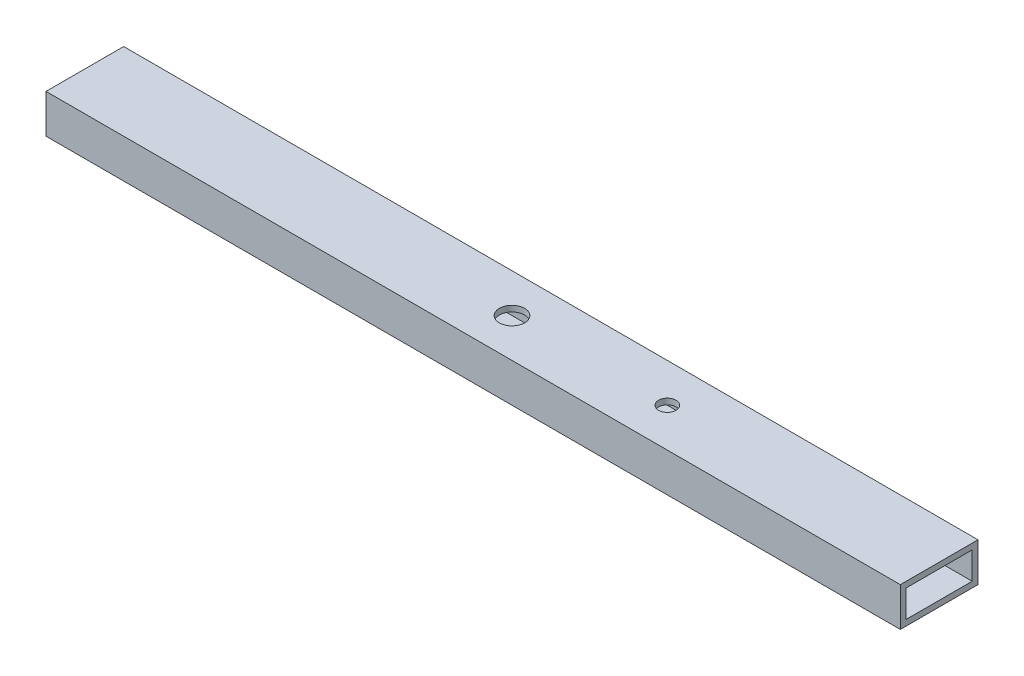
ISO-10303-21;
HEADER;
FILE_DESCRIPTION(('STEP AP214'),'2;1');
FILE_NAME('part.step','',(''),(''),'','','');
FILE_SCHEMA(('AUTOMOTIVE_DESIGN { 1 0 10303 214 1 1 1 1 }'));
ENDSEC;
DATA;
#1=APPLICATION_CONTEXT('core data for automotive mechanical design processes');
#2=APPLICATION_PROTOCOL_DEFINITION('international standard','automotive_design',2000,#1);
#3=PRODUCT_CONTEXT('',#1,'mechanical');
#4=PRODUCT('Part','Part','',(#3));
#5=PRODUCT_RELATED_PRODUCT_CATEGORY('part','',(#4));
#6=PRODUCT_DEFINITION_FORMATION('','',#4);
#7=PRODUCT_DEFINITION_CONTEXT('part definition',#1,'design');
#8=PRODUCT_DEFINITION('design','',#6,#7);
#9=PRODUCT_DEFINITION_SHAPE('','',#8);
#10=(LENGTH_UNIT() NAMED_UNIT(*) SI_UNIT(.MILLI.,.METRE.));
#11=(NAMED_UNIT(*) PLANE_ANGLE_UNIT() SI_UNIT($,.RADIAN.));
#12=(NAMED_UNIT(*) SI_UNIT($,.STERADIAN.) SOLID_ANGLE_UNIT());
#13=UNCERTAINTY_MEASURE_WITH_UNIT(LENGTH_MEASURE(1.E-05),#10,'distance_accuracy_value','');
#14=(GEOMETRIC_REPRESENTATION_CONTEXT(3) GLOBAL_UNCERTAINTY_ASSIGNED_CONTEXT((#13)) GLOBAL_UNIT_ASSIGNED_CONTEXT((#10,
#11,#12)) REPRESENTATION_CONTEXT('',''));
#15=CARTESIAN_POINT('',(0.,0.,0.));
#16=DIRECTION('',(0.,0.,1.));
#17=DIRECTION('',(1.,0.,0.));
#18=AXIS2_PLACEMENT_3D('',#15,#16,#17);
#19=CARTESIAN_POINT('',(220.,0.,0.));
#20=DIRECTION('',(1.,0.,0.));
#21=DIRECTION('',(0.,0.,-1.));
#22=AXIS2_PLACEMENT_3D('',#19,#20,#21);
#23=PLANE('',#22);
#24=DIRECTION('',(0.,1.,0.));
#25=VECTOR('',#24,1.);
#26=CARTESIAN_POINT('',(220.,5.,-10.));
#27=LINE('',#26,#25);
#28=CARTESIAN_POINT('',(220.,-5.,-10.));
#29=VERTEX_POINT('',#28);
#30=CARTESIAN_POINT('',(220.,5.,-10.));
#31=VERTEX_POINT('',#30);
#32=EDGE_CURVE('E138',#29,#31,#27,.T.);
#33=ORIENTED_EDGE('',*,*,#32,.T.);
#34=DIRECTION('',(0.,0.,1.));
#35=VECTOR('',#34,1.);
#36=CARTESIAN_POINT('',(220.,5.,10.));
#37=LINE('',#36,#35);
#38=CARTESIAN_POINT('',(220.,5.,10.));
#39=VERTEX_POINT('',#38);
#40=EDGE_CURVE('E141',#31,#39,#37,.T.);
#41=ORIENTED_EDGE('',*,*,#40,.T.);
#42=DIRECTION('',(0.,-1.,0.));
#43=VECTOR('',#42,1.);
#44=CARTESIAN_POINT('',(220.,5.,10.));
#45=LINE('',#44,#43);
#46=CARTESIAN_POINT('',(220.,-5.,10.));
#47=VERTEX_POINT('',#46);
#48=EDGE_CURVE('E144',#39,#47,#45,.T.);
#49=ORIENTED_EDGE('',*,*,#48,.T.);
#50=DIRECTION('',(0.,0.,-1.));
#51=VECTOR('',#50,1.);
#52=CARTESIAN_POINT('',(220.,-5.,10.));
#53=LINE('',#52,#51);
#54=EDGE_CURVE('E146',#47,#29,#53,.T.);
#55=ORIENTED_EDGE('',*,*,#54,.T.);
#56=EDGE_LOOP('',(#33,#41,#49,#55));
#57=FACE_BOUND('',#56,.T.);
#58=DIRECTION('',(0.,0.,-1.));
#59=VECTOR('',#58,1.);
#60=CARTESIAN_POINT('',(220.,-3.5,8.5));
#61=LINE('',#60,#59);
#62=CARTESIAN_POINT('',(220.,-3.5,8.5));
#63=VERTEX_POINT('',#62);
#64=CARTESIAN_POINT('',(220.,-3.5,-8.5));
#65=VERTEX_POINT('',#64);
#66=EDGE_CURVE('E108',#63,#65,#61,.T.);
#67=ORIENTED_EDGE('',*,*,#66,.F.);
#68=DIRECTION('',(0.,-1.,0.));
#69=VECTOR('',#68,1.);
#70=CARTESIAN_POINT('',(220.,3.5,8.5));
#71=LINE('',#70,#69);
#72=CARTESIAN_POINT('',(220.,3.5,8.5));
#73=VERTEX_POINT('',#72);
#74=EDGE_CURVE('E100',#73,#63,#71,.T.);
#75=ORIENTED_EDGE('',*,*,#74,.F.);
#76=DIRECTION('',(0.,0.,1.));
#77=VECTOR('',#76,1.);
#78=CARTESIAN_POINT('',(220.,3.5,8.5));
#79=LINE('',#78,#77);
#80=CARTESIAN_POINT('',(220.,3.5,-8.5));
#81=VERTEX_POINT('',#80);
#82=EDGE_CURVE('E122',#81,#73,#79,.T.);
#83=ORIENTED_EDGE('',*,*,#82,.F.);
#84=DIRECTION('',(0.,1.,0.));
#85=VECTOR('',#84,1.);
#86=CARTESIAN_POINT('',(220.,3.5,-8.5));
#87=LINE('',#86,#85);
#88=EDGE_CURVE('E120',#65,#81,#87,.T.);
#89=ORIENTED_EDGE('',*,*,#88,.F.);
#90=EDGE_LOOP('',(#67,#75,#83,#89));
#91=FACE_BOUND('',#90,.T.);
#92=ADVANCED_FACE('F33',(#57,#91),#23,.T.);
#93=CARTESIAN_POINT('',(0.,0.,0.));
#94=DIRECTION('',(1.,0.,0.));
#95=DIRECTION('',(0.,0.,-1.));
#96=AXIS2_PLACEMENT_3D('',#93,#94,#95);
#97=PLANE('',#96);
#98=DIRECTION('',(0.,1.,0.));
#99=VECTOR('',#98,1.);
#100=CARTESIAN_POINT('',(0.,5.,-10.));
#101=LINE('',#100,#99);
#102=CARTESIAN_POINT('',(0.,-5.,-10.));
#103=VERTEX_POINT('',#102);
#104=CARTESIAN_POINT('',(0.,5.,-10.));
#105=VERTEX_POINT('',#104);
#106=EDGE_CURVE('E116',#103,#105,#101,.T.);
#107=ORIENTED_EDGE('',*,*,#106,.F.);
#108=DIRECTION('',(0.,0.,-1.));
#109=VECTOR('',#108,1.);
#110=CARTESIAN_POINT('',(0.,-5.,10.));
#111=LINE('',#110,#109);
#112=CARTESIAN_POINT('',(0.,-5.,10.));
#113=VERTEX_POINT('',#112);
#114=EDGE_CURVE('E142',#113,#103,#111,.T.);
#115=ORIENTED_EDGE('',*,*,#114,.F.);
#116=DIRECTION('',(0.,-1.,0.));
#117=VECTOR('',#116,1.);
#118=CARTESIAN_POINT('',(0.,5.,10.));
#119=LINE('',#118,#117);
#120=CARTESIAN_POINT('',(0.,5.,10.));
#121=VERTEX_POINT('',#120);
#122=EDGE_CURVE('E153',#121,#113,#119,.T.);
#123=ORIENTED_EDGE('',*,*,#122,.F.);
#124=DIRECTION('',(0.,0.,1.));
#125=VECTOR('',#124,1.);
#126=CARTESIAN_POINT('',(0.,5.,10.));
#127=LINE('',#126,#125);
#128=EDGE_CURVE('E151',#105,#121,#127,.T.);
#129=ORIENTED_EDGE('',*,*,#128,.F.);
#130=EDGE_LOOP('',(#107,#115,#123,#129));
#131=FACE_BOUND('',#130,.T.);
#132=DIRECTION('',(0.,-1.,0.));
#133=VECTOR('',#132,1.);
#134=CARTESIAN_POINT('',(0.,3.5,8.5));
#135=LINE('',#134,#133);
#136=CARTESIAN_POINT('',(0.,3.5,8.5));
#137=VERTEX_POINT('',#136);
#138=CARTESIAN_POINT('',(0.,-3.5,8.5));
#139=VERTEX_POINT('',#138);
#140=EDGE_CURVE('E58',#137,#139,#135,.T.);
#141=ORIENTED_EDGE('',*,*,#140,.T.);
#142=DIRECTION('',(0.,0.,-1.));
#143=VECTOR('',#142,1.);
#144=CARTESIAN_POINT('',(0.,-3.5,8.5));
#145=LINE('',#144,#143);
#146=CARTESIAN_POINT('',(0.,-3.5,-8.5));
#147=VERTEX_POINT('',#146);
#148=EDGE_CURVE('E115',#139,#147,#145,.T.);
#149=ORIENTED_EDGE('',*,*,#148,.T.);
#150=DIRECTION('',(0.,1.,0.));
#151=VECTOR('',#150,1.);
#152=CARTESIAN_POINT('',(0.,3.5,-8.5));
#153=LINE('',#152,#151);
#154=CARTESIAN_POINT('',(0.,3.5,-8.5));
#155=VERTEX_POINT('',#154);
#156=EDGE_CURVE('E130',#147,#155,#153,.T.);
#157=ORIENTED_EDGE('',*,*,#156,.T.);
#158=DIRECTION('',(0.,0.,1.));
#159=VECTOR('',#158,1.);
#160=CARTESIAN_POINT('',(0.,3.5,8.5));
#161=LINE('',#160,#159);
#162=EDGE_CURVE('E109',#155,#137,#161,.T.);
#163=ORIENTED_EDGE('',*,*,#162,.T.);
#164=EDGE_LOOP('',(#141,#149,#157,#163));
#165=FACE_BOUND('',#164,.T.);
#166=ADVANCED_FACE('F200',(#131,#165),#97,.F.);
#167=CARTESIAN_POINT('',(220.,5.,-10.));
#168=DIRECTION('',(0.,0.,1.));
#169=DIRECTION('',(1.,0.,0.));
#170=AXIS2_PLACEMENT_3D('',#167,#168,#169);
#171=PLANE('',#170);
#172=ORIENTED_EDGE('',*,*,#106,.T.);
#173=DIRECTION('',(-1.,0.,0.));
#174=VECTOR('',#173,1.);
#175=CARTESIAN_POINT('',(220.,5.,-10.));
#176=LINE('',#175,#174);
#177=EDGE_CURVE('E11',#31,#105,#176,.T.);
#178=ORIENTED_EDGE('',*,*,#177,.F.);
#179=ORIENTED_EDGE('',*,*,#32,.F.);
#180=DIRECTION('',(-1.,0.,0.));
#181=VECTOR('',#180,1.);
#182=CARTESIAN_POINT('',(220.,-5.,-10.));
#183=LINE('',#182,#181);
#184=EDGE_CURVE('E148',#29,#103,#183,.T.);
#185=ORIENTED_EDGE('',*,*,#184,.T.);
#186=EDGE_LOOP('',(#172,#178,#179,#185));
#187=FACE_BOUND('',#186,.T.);
#188=ADVANCED_FACE('F35',(#187),#171,.F.);
#189=CARTESIAN_POINT('',(220.,5.,10.));
#190=DIRECTION('',(0.,-1.,0.));
#191=DIRECTION('',(0.,0.,-1.));
#192=AXIS2_PLACEMENT_3D('',#189,#190,#191);
#193=PLANE('',#192);
#194=CARTESIAN_POINT('',(150.,5.,0.));
#195=DIRECTION('',(0.,1.,0.));
#196=DIRECTION('',(0.,0.,1.));
#197=AXIS2_PLACEMENT_3D('',#194,#195,#196);
#198=CIRCLE('',#197,2.25000000000001);
#199=CARTESIAN_POINT('',(150.,5.,2.25000000000001));
#200=VERTEX_POINT('',#199);
#201=EDGE_CURVE('E179',#200,#200,#198,.T.);
#202=ORIENTED_EDGE('',*,*,#201,.F.);
#203=EDGE_LOOP('',(#202));
#204=FACE_BOUND('',#203,.T.);
#205=CARTESIAN_POINT('',(110.,5.,0.));
#206=DIRECTION('',(0.,1.,0.));
#207=DIRECTION('',(0.,0.,1.));
#208=AXIS2_PLACEMENT_3D('',#205,#206,#207);
#209=CIRCLE('',#208,3.25000000000001);
#210=CARTESIAN_POINT('',(110.,5.,3.25000000000001));
#211=VERTEX_POINT('',#210);
#212=EDGE_CURVE('E169',#211,#211,#209,.T.);
#213=ORIENTED_EDGE('',*,*,#212,.F.);
#214=EDGE_LOOP('',(#213));
#215=FACE_BOUND('',#214,.T.);
#216=ORIENTED_EDGE('',*,*,#128,.T.);
#217=DIRECTION('',(-1.,0.,0.));
#218=VECTOR('',#217,1.);
#219=CARTESIAN_POINT('',(220.,5.,10.));
#220=LINE('',#219,#218);
#221=EDGE_CURVE('E42',#39,#121,#220,.T.);
#222=ORIENTED_EDGE('',*,*,#221,.F.);
#223=ORIENTED_EDGE('',*,*,#40,.F.);
#224=ORIENTED_EDGE('',*,*,#177,.T.);
#225=EDGE_LOOP('',(#216,#222,#223,#224));
#226=FACE_BOUND('',#225,.T.);
#227=ADVANCED_FACE('F224',(#204,#215,#226),#193,.F.);
#228=CARTESIAN_POINT('',(220.,5.,10.));
#229=DIRECTION('',(0.,0.,-1.));
#230=DIRECTION('',(0.,1.,0.));
#231=AXIS2_PLACEMENT_3D('',#228,#229,#230);
#232=PLANE('',#231);
#233=ORIENTED_EDGE('',*,*,#122,.T.);
#234=DIRECTION('',(-1.,0.,0.));
#235=VECTOR('',#234,1.);
#236=CARTESIAN_POINT('',(220.,-5.,10.));
#237=LINE('',#236,#235);
#238=EDGE_CURVE('E158',#47,#113,#237,.T.);
#239=ORIENTED_EDGE('',*,*,#238,.F.);
#240=ORIENTED_EDGE('',*,*,#48,.F.);
#241=ORIENTED_EDGE('',*,*,#221,.T.);
#242=EDGE_LOOP('',(#233,#239,#240,#241));
#243=FACE_BOUND('',#242,.T.);
#244=ADVANCED_FACE('F222',(#243),#232,.F.);
#245=CARTESIAN_POINT('',(220.,-5.,10.));
#246=DIRECTION('',(0.,1.,0.));
#247=DIRECTION('',(0.,0.,1.));
#248=AXIS2_PLACEMENT_3D('',#245,#246,#247);
#249=PLANE('',#248);
#250=CARTESIAN_POINT('',(150.,-5.,0.));
#251=DIRECTION('',(0.,1.,0.));
#252=DIRECTION('',(0.,0.,1.));
#253=AXIS2_PLACEMENT_3D('',#250,#251,#252);
#254=CIRCLE('',#253,2.25000000000001);
#255=CARTESIAN_POINT('',(150.,-5.,2.25000000000001));
#256=VERTEX_POINT('',#255);
#257=EDGE_CURVE('E182',#256,#256,#254,.T.);
#258=ORIENTED_EDGE('',*,*,#257,.T.);
#259=EDGE_LOOP('',(#258));
#260=FACE_BOUND('',#259,.T.);
#261=CARTESIAN_POINT('',(110.,-5.,0.));
#262=DIRECTION('',(0.,1.,0.));
#263=DIRECTION('',(0.,0.,1.));
#264=AXIS2_PLACEMENT_3D('',#261,#262,#263);
#265=CIRCLE('',#264,3.25000000000001);
#266=CARTESIAN_POINT('',(110.,-5.,3.25000000000001));
#267=VERTEX_POINT('',#266);
#268=EDGE_CURVE('E164',#267,#267,#265,.T.);
#269=ORIENTED_EDGE('',*,*,#268,.T.);
#270=EDGE_LOOP('',(#269));
#271=FACE_BOUND('',#270,.T.);
#272=ORIENTED_EDGE('',*,*,#114,.T.);
#273=ORIENTED_EDGE('',*,*,#184,.F.);
#274=ORIENTED_EDGE('',*,*,#54,.F.);
#275=ORIENTED_EDGE('',*,*,#238,.T.);
#276=EDGE_LOOP('',(#272,#273,#274,#275));
#277=FACE_BOUND('',#276,.T.);
#278=ADVANCED_FACE('F219',(#260,#271,#277),#249,.F.);
#279=CARTESIAN_POINT('',(220.,3.5,8.5));
#280=DIRECTION('',(0.,0.,-1.));
#281=DIRECTION('',(0.,1.,0.));
#282=AXIS2_PLACEMENT_3D('',#279,#280,#281);
#283=PLANE('',#282);
#284=ORIENTED_EDGE('',*,*,#140,.F.);
#285=DIRECTION('',(-1.,0.,0.));
#286=VECTOR('',#285,1.);
#287=CARTESIAN_POINT('',(220.,3.5,8.5));
#288=LINE('',#287,#286);
#289=EDGE_CURVE('E104',#73,#137,#288,.T.);
#290=ORIENTED_EDGE('',*,*,#289,.F.);
#291=ORIENTED_EDGE('',*,*,#74,.T.);
#292=DIRECTION('',(-1.,0.,0.));
#293=VECTOR('',#292,1.);
#294=CARTESIAN_POINT('',(220.,-3.5,8.5));
#295=LINE('',#294,#293);
#296=EDGE_CURVE('E103',#63,#139,#295,.T.);
#297=ORIENTED_EDGE('',*,*,#296,.T.);
#298=EDGE_LOOP('',(#284,#290,#291,#297));
#299=FACE_BOUND('',#298,.T.);
#300=ADVANCED_FACE('F102',(#299),#283,.T.);
#301=CARTESIAN_POINT('',(220.,-3.5,8.5));
#302=DIRECTION('',(0.,1.,0.));
#303=DIRECTION('',(0.,0.,1.));
#304=AXIS2_PLACEMENT_3D('',#301,#302,#303);
#305=PLANE('',#304);
#306=CARTESIAN_POINT('',(150.,-3.5,0.));
#307=DIRECTION('',(0.,1.,0.));
#308=DIRECTION('',(0.,0.,1.));
#309=AXIS2_PLACEMENT_3D('',#306,#307,#308);
#310=CIRCLE('',#309,2.25000000000001);
#311=CARTESIAN_POINT('',(150.,-3.5,2.25000000000001));
#312=VERTEX_POINT('',#311);
#313=EDGE_CURVE('E174',#312,#312,#310,.T.);
#314=ORIENTED_EDGE('',*,*,#313,.F.);
#315=EDGE_LOOP('',(#314));
#316=FACE_BOUND('',#315,.T.);
#317=CARTESIAN_POINT('',(110.,-3.5,0.));
#318=DIRECTION('',(0.,1.,0.));
#319=DIRECTION('',(0.,0.,1.));
#320=AXIS2_PLACEMENT_3D('',#317,#318,#319);
#321=CIRCLE('',#320,3.25000000000001);
#322=CARTESIAN_POINT('',(110.,-3.5,3.25000000000001));
#323=VERTEX_POINT('',#322);
#324=EDGE_CURVE('E128',#323,#323,#321,.T.);
#325=ORIENTED_EDGE('',*,*,#324,.F.);
#326=EDGE_LOOP('',(#325));
#327=FACE_BOUND('',#326,.T.);
#328=ORIENTED_EDGE('',*,*,#148,.F.);
#329=ORIENTED_EDGE('',*,*,#296,.F.);
#330=ORIENTED_EDGE('',*,*,#66,.T.);
#331=DIRECTION('',(-1.,0.,0.));
#332=VECTOR('',#331,1.);
#333=CARTESIAN_POINT('',(220.,-3.5,-8.5));
#334=LINE('',#333,#332);
#335=EDGE_CURVE('E117',#65,#147,#334,.T.);
#336=ORIENTED_EDGE('',*,*,#335,.T.);
#337=EDGE_LOOP('',(#328,#329,#330,#336));
#338=FACE_BOUND('',#337,.T.);
#339=ADVANCED_FACE('F112',(#316,#327,#338),#305,.T.);
#340=CARTESIAN_POINT('',(220.,3.5,-8.5));
#341=DIRECTION('',(0.,0.,1.));
#342=DIRECTION('',(1.,0.,0.));
#343=AXIS2_PLACEMENT_3D('',#340,#341,#342);
#344=PLANE('',#343);
#345=ORIENTED_EDGE('',*,*,#156,.F.);
#346=ORIENTED_EDGE('',*,*,#335,.F.);
#347=ORIENTED_EDGE('',*,*,#88,.T.);
#348=DIRECTION('',(-1.,0.,0.));
#349=VECTOR('',#348,1.);
#350=CARTESIAN_POINT('',(220.,3.5,-8.5));
#351=LINE('',#350,#349);
#352=EDGE_CURVE('E50',#81,#155,#351,.T.);
#353=ORIENTED_EDGE('',*,*,#352,.T.);
#354=EDGE_LOOP('',(#345,#346,#347,#353));
#355=FACE_BOUND('',#354,.T.);
#356=ADVANCED_FACE('F196',(#355),#344,.T.);
#357=CARTESIAN_POINT('',(220.,3.5,8.5));
#358=DIRECTION('',(0.,-1.,0.));
#359=DIRECTION('',(0.,0.,-1.));
#360=AXIS2_PLACEMENT_3D('',#357,#358,#359);
#361=PLANE('',#360);
#362=CARTESIAN_POINT('',(150.,3.5,0.));
#363=DIRECTION('',(0.,-1.,0.));
#364=DIRECTION('',(0.,0.,-1.));
#365=AXIS2_PLACEMENT_3D('',#362,#363,#364);
#366=CIRCLE('',#365,2.25000000000001);
#367=CARTESIAN_POINT('',(150.,3.5,-2.25000000000001));
#368=VERTEX_POINT('',#367);
#369=EDGE_CURVE('E37',#368,#368,#366,.T.);
#370=ORIENTED_EDGE('',*,*,#369,.F.);
#371=EDGE_LOOP('',(#370));
#372=FACE_BOUND('',#371,.T.);
#373=CARTESIAN_POINT('',(110.,3.5,0.));
#374=DIRECTION('',(0.,-1.,0.));
#375=DIRECTION('',(0.,0.,-1.));
#376=AXIS2_PLACEMENT_3D('',#373,#374,#375);
#377=CIRCLE('',#376,3.25000000000001);
#378=CARTESIAN_POINT('',(110.,3.5,-3.25000000000001));
#379=VERTEX_POINT('',#378);
#380=EDGE_CURVE('E162',#379,#379,#377,.T.);
#381=ORIENTED_EDGE('',*,*,#380,.F.);
#382=EDGE_LOOP('',(#381));
#383=FACE_BOUND('',#382,.T.);
#384=ORIENTED_EDGE('',*,*,#162,.F.);
#385=ORIENTED_EDGE('',*,*,#352,.F.);
#386=ORIENTED_EDGE('',*,*,#82,.T.);
#387=ORIENTED_EDGE('',*,*,#289,.T.);
#388=EDGE_LOOP('',(#384,#385,#386,#387));
#389=FACE_BOUND('',#388,.T.);
#390=ADVANCED_FACE('F192',(#372,#383,#389),#361,.T.);
#391=CARTESIAN_POINT('',(110.,-5.,0.));
#392=DIRECTION('',(0.,1.,0.));
#393=DIRECTION('',(0.,0.,1.));
#394=AXIS2_PLACEMENT_3D('',#391,#392,#393);
#395=CYLINDRICAL_SURFACE('',#394,3.25000000000001);
#396=ORIENTED_EDGE('',*,*,#380,.T.);
#397=EDGE_LOOP('',(#396));
#398=FACE_BOUND('',#397,.T.);
#399=ORIENTED_EDGE('',*,*,#212,.T.);
#400=EDGE_LOOP('',(#399));
#401=FACE_BOUND('',#400,.T.);
#402=ADVANCED_FACE('F195',(#398,#401),#395,.F.);
#403=ORIENTED_EDGE('',*,*,#324,.T.);
#404=EDGE_LOOP('',(#403));
#405=FACE_BOUND('',#404,.T.);
#406=ORIENTED_EDGE('',*,*,#268,.F.);
#407=EDGE_LOOP('',(#406));
#408=FACE_BOUND('',#407,.T.);
#409=ADVANCED_FACE('F249',(#405,#408),#395,.F.);
#410=CARTESIAN_POINT('',(150.,-5.,0.));
#411=DIRECTION('',(0.,1.,0.));
#412=DIRECTION('',(0.,0.,1.));
#413=AXIS2_PLACEMENT_3D('',#410,#411,#412);
#414=CYLINDRICAL_SURFACE('',#413,2.25000000000001);
#415=ORIENTED_EDGE('',*,*,#369,.T.);
#416=EDGE_LOOP('',(#415));
#417=FACE_BOUND('',#416,.T.);
#418=ORIENTED_EDGE('',*,*,#201,.T.);
#419=EDGE_LOOP('',(#418));
#420=FACE_BOUND('',#419,.T.);
#421=ADVANCED_FACE('F189',(#417,#420),#414,.F.);
#422=ORIENTED_EDGE('',*,*,#313,.T.);
#423=EDGE_LOOP('',(#422));
#424=FACE_BOUND('',#423,.T.);
#425=ORIENTED_EDGE('',*,*,#257,.F.);
#426=EDGE_LOOP('',(#425));
#427=FACE_BOUND('',#426,.T.);
#428=ADVANCED_FACE('F257',(#424,#427),#414,.F.);
#429=CLOSED_SHELL('',(#92,#166,#188,#227,#244,#278,#300,#339,#356,#390,#402,#409,#421,#428));
#430=MANIFOLD_SOLID_BREP('B2',#429);
#431=ADVANCED_BREP_SHAPE_REPRESENTATION('',(#18,#430),#14);
#432=SHAPE_DEFINITION_REPRESENTATION(#9,#431);
ENDSEC;
END-ISO-10303-21;
